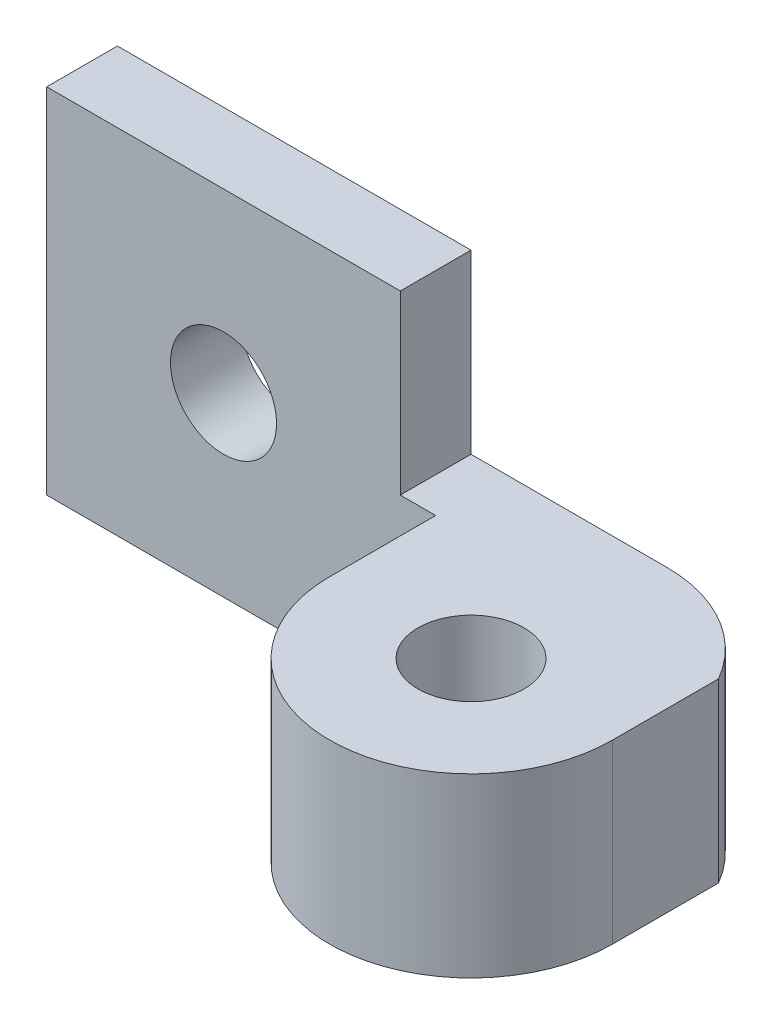
ISO-10303-21;
HEADER;
FILE_DESCRIPTION(('STEP AP214'),'2;1');
FILE_NAME('part.step','',(''),(''),'','','');
FILE_SCHEMA(('AUTOMOTIVE_DESIGN { 1 0 10303 214 1 1 1 1 }'));
ENDSEC;
DATA;
#1=APPLICATION_CONTEXT('core data for automotive mechanical design processes');
#2=APPLICATION_PROTOCOL_DEFINITION('international standard','automotive_design',2000,#1);
#3=PRODUCT_CONTEXT('',#1,'mechanical');
#4=PRODUCT('Part','Part','',(#3));
#5=PRODUCT_RELATED_PRODUCT_CATEGORY('part','',(#4));
#6=PRODUCT_DEFINITION_FORMATION('','',#4);
#7=PRODUCT_DEFINITION_CONTEXT('part definition',#1,'design');
#8=PRODUCT_DEFINITION('design','',#6,#7);
#9=PRODUCT_DEFINITION_SHAPE('','',#8);
#10=(LENGTH_UNIT() NAMED_UNIT(*) SI_UNIT(.MILLI.,.METRE.));
#11=(NAMED_UNIT(*) PLANE_ANGLE_UNIT() SI_UNIT($,.RADIAN.));
#12=(NAMED_UNIT(*) SI_UNIT($,.STERADIAN.) SOLID_ANGLE_UNIT());
#13=UNCERTAINTY_MEASURE_WITH_UNIT(LENGTH_MEASURE(1.E-05),#10,'distance_accuracy_value','');
#14=(GEOMETRIC_REPRESENTATION_CONTEXT(3) GLOBAL_UNCERTAINTY_ASSIGNED_CONTEXT((#13)) GLOBAL_UNIT_ASSIGNED_CONTEXT((#10,
#11,#12)) REPRESENTATION_CONTEXT('',''));
#15=CARTESIAN_POINT('',(0.,0.,0.));
#16=DIRECTION('',(0.,0.,1.));
#17=DIRECTION('',(1.,0.,0.));
#18=AXIS2_PLACEMENT_3D('',#15,#16,#17);
#19=CARTESIAN_POINT('',(0.,0.,2.));
#20=DIRECTION('',(0.,0.,1.));
#21=DIRECTION('',(1.,0.,0.));
#22=AXIS2_PLACEMENT_3D('',#19,#20,#21);
#23=PLANE('',#22);
#24=DIRECTION('',(0.,-1.,0.));
#25=VECTOR('',#24,1.);
#26=CARTESIAN_POINT('',(11.,0.,2.));
#27=LINE('',#26,#25);
#28=CARTESIAN_POINT('',(11.,5.,2.));
#29=VERTEX_POINT('',#28);
#30=CARTESIAN_POINT('',(11.,0.,2.));
#31=VERTEX_POINT('',#30);
#32=EDGE_CURVE('E52',#29,#31,#27,.T.);
#33=ORIENTED_EDGE('',*,*,#32,.F.);
#34=DIRECTION('',(-1.,0.,0.));
#35=VECTOR('',#34,1.);
#36=CARTESIAN_POINT('',(10.,5.,2.));
#37=LINE('',#36,#35);
#38=CARTESIAN_POINT('',(10.,5.,2.));
#39=VERTEX_POINT('',#38);
#40=EDGE_CURVE('E123',#29,#39,#37,.T.);
#41=ORIENTED_EDGE('',*,*,#40,.T.);
#42=DIRECTION('',(0.,1.,0.));
#43=VECTOR('',#42,1.);
#44=CARTESIAN_POINT('',(10.,10.,2.));
#45=LINE('',#44,#43);
#46=CARTESIAN_POINT('',(10.,10.,2.));
#47=VERTEX_POINT('',#46);
#48=EDGE_CURVE('E164',#39,#47,#45,.T.);
#49=ORIENTED_EDGE('',*,*,#48,.T.);
#50=DIRECTION('',(-1.,0.,0.));
#51=VECTOR('',#50,1.);
#52=CARTESIAN_POINT('',(0.,10.,2.));
#53=LINE('',#52,#51);
#54=CARTESIAN_POINT('',(0.,10.,2.));
#55=VERTEX_POINT('',#54);
#56=EDGE_CURVE('E166',#47,#55,#53,.T.);
#57=ORIENTED_EDGE('',*,*,#56,.T.);
#58=DIRECTION('',(0.,-1.,0.));
#59=VECTOR('',#58,1.);
#60=CARTESIAN_POINT('',(0.,10.,2.));
#61=LINE('',#60,#59);
#62=CARTESIAN_POINT('',(0.,0.,2.));
#63=VERTEX_POINT('',#62);
#64=EDGE_CURVE('E159',#55,#63,#61,.T.);
#65=ORIENTED_EDGE('',*,*,#64,.T.);
#66=DIRECTION('',(1.,0.,0.));
#67=VECTOR('',#66,1.);
#68=CARTESIAN_POINT('',(0.,0.,2.));
#69=LINE('',#68,#67);
#70=EDGE_CURVE('E48',#63,#31,#69,.T.);
#71=ORIENTED_EDGE('',*,*,#70,.T.);
#72=EDGE_LOOP('',(#33,#41,#49,#57,#65,#71));
#73=FACE_BOUND('',#72,.T.);
#74=CARTESIAN_POINT('',(5.,5.,2.));
#75=DIRECTION('',(0.,0.,1.));
#76=DIRECTION('',(1.,0.,0.));
#77=AXIS2_PLACEMENT_3D('',#74,#75,#76);
#78=CIRCLE('',#77,1.5);
#79=CARTESIAN_POINT('',(6.5,5.,2.));
#80=VERTEX_POINT('',#79);
#81=EDGE_CURVE('E153',#80,#80,#78,.T.);
#82=ORIENTED_EDGE('',*,*,#81,.F.);
#83=EDGE_LOOP('',(#82));
#84=FACE_BOUND('',#83,.T.);
#85=ADVANCED_FACE('F33',(#73,#84),#23,.T.);
#86=CARTESIAN_POINT('',(0.,0.,0.));
#87=DIRECTION('',(0.,0.,1.));
#88=DIRECTION('',(1.,0.,0.));
#89=AXIS2_PLACEMENT_3D('',#86,#87,#88);
#90=PLANE('',#89);
#91=DIRECTION('',(0.,1.,0.));
#92=VECTOR('',#91,1.);
#93=CARTESIAN_POINT('',(10.,10.,0.));
#94=LINE('',#93,#92);
#95=CARTESIAN_POINT('',(10.,5.,0.));
#96=VERTEX_POINT('',#95);
#97=CARTESIAN_POINT('',(10.,10.,0.));
#98=VERTEX_POINT('',#97);
#99=EDGE_CURVE('E175',#96,#98,#94,.T.);
#100=ORIENTED_EDGE('',*,*,#99,.F.);
#101=DIRECTION('',(-1.,0.,0.));
#102=VECTOR('',#101,1.);
#103=CARTESIAN_POINT('',(10.,5.,0.));
#104=LINE('',#103,#102);
#105=CARTESIAN_POINT('',(15.5358983848622,5.,0.));
#106=VERTEX_POINT('',#105);
#107=EDGE_CURVE('E173',#106,#96,#104,.T.);
#108=ORIENTED_EDGE('',*,*,#107,.F.);
#109=DIRECTION('',(0.,-1.,0.));
#110=VECTOR('',#109,1.);
#111=CARTESIAN_POINT('',(15.5358983848622,5.,0.));
#112=LINE('',#111,#110);
#113=CARTESIAN_POINT('',(15.5358983848622,0.,0.));
#114=VERTEX_POINT('',#113);
#115=EDGE_CURVE('E112',#106,#114,#112,.T.);
#116=ORIENTED_EDGE('',*,*,#115,.T.);
#117=DIRECTION('',(1.,0.,0.));
#118=VECTOR('',#117,1.);
#119=CARTESIAN_POINT('',(0.,0.,0.));
#120=LINE('',#119,#118);
#121=CARTESIAN_POINT('',(0.,0.,0.));
#122=VERTEX_POINT('',#121);
#123=EDGE_CURVE('E171',#122,#114,#120,.T.);
#124=ORIENTED_EDGE('',*,*,#123,.F.);
#125=DIRECTION('',(0.,-1.,0.));
#126=VECTOR('',#125,1.);
#127=CARTESIAN_POINT('',(0.,10.,0.));
#128=LINE('',#127,#126);
#129=CARTESIAN_POINT('',(0.,10.,0.));
#130=VERTEX_POINT('',#129);
#131=EDGE_CURVE('E156',#130,#122,#128,.T.);
#132=ORIENTED_EDGE('',*,*,#131,.F.);
#133=DIRECTION('',(-1.,0.,0.));
#134=VECTOR('',#133,1.);
#135=CARTESIAN_POINT('',(0.,10.,0.));
#136=LINE('',#135,#134);
#137=EDGE_CURVE('E161',#98,#130,#136,.T.);
#138=ORIENTED_EDGE('',*,*,#137,.F.);
#139=EDGE_LOOP('',(#100,#108,#116,#124,#132,#138));
#140=FACE_BOUND('',#139,.T.);
#141=CARTESIAN_POINT('',(5.,5.,0.));
#142=DIRECTION('',(0.,0.,1.));
#143=DIRECTION('',(1.,0.,0.));
#144=AXIS2_PLACEMENT_3D('',#141,#142,#143);
#145=CIRCLE('',#144,1.5);
#146=CARTESIAN_POINT('',(6.5,5.,0.));
#147=VERTEX_POINT('',#146);
#148=EDGE_CURVE('E152',#147,#147,#145,.T.);
#149=ORIENTED_EDGE('',*,*,#148,.T.);
#150=EDGE_LOOP('',(#149));
#151=FACE_BOUND('',#150,.T.);
#152=ADVANCED_FACE('F190',(#140,#151),#90,.F.);
#153=CARTESIAN_POINT('',(0.,10.,2.));
#154=DIRECTION('',(1.,0.,0.));
#155=DIRECTION('',(0.,1.,0.));
#156=AXIS2_PLACEMENT_3D('',#153,#154,#155);
#157=PLANE('',#156);
#158=ORIENTED_EDGE('',*,*,#131,.T.);
#159=DIRECTION('',(0.,0.,-1.));
#160=VECTOR('',#159,1.);
#161=CARTESIAN_POINT('',(0.,0.,2.));
#162=LINE('',#161,#160);
#163=EDGE_CURVE('E11',#63,#122,#162,.T.);
#164=ORIENTED_EDGE('',*,*,#163,.F.);
#165=ORIENTED_EDGE('',*,*,#64,.F.);
#166=DIRECTION('',(0.,0.,-1.));
#167=VECTOR('',#166,1.);
#168=CARTESIAN_POINT('',(0.,10.,2.));
#169=LINE('',#168,#167);
#170=EDGE_CURVE('E168',#55,#130,#169,.T.);
#171=ORIENTED_EDGE('',*,*,#170,.T.);
#172=EDGE_LOOP('',(#158,#164,#165,#171));
#173=FACE_BOUND('',#172,.T.);
#174=ADVANCED_FACE('F35',(#173),#157,.F.);
#175=CARTESIAN_POINT('',(0.,0.,2.));
#176=DIRECTION('',(0.,1.,0.));
#177=DIRECTION('',(0.,0.,1.));
#178=AXIS2_PLACEMENT_3D('',#175,#176,#177);
#179=PLANE('',#178);
#180=DIRECTION('',(0.,0.,-1.));
#181=VECTOR('',#180,1.);
#182=CARTESIAN_POINT('',(11.,0.,5.));
#183=LINE('',#182,#181);
#184=CARTESIAN_POINT('',(11.,0.,5.));
#185=VERTEX_POINT('',#184);
#186=EDGE_CURVE('E107',#185,#31,#183,.T.);
#187=ORIENTED_EDGE('',*,*,#186,.T.);
#188=ORIENTED_EDGE('',*,*,#70,.F.);
#189=ORIENTED_EDGE('',*,*,#163,.T.);
#190=ORIENTED_EDGE('',*,*,#123,.T.);
#191=CARTESIAN_POINT('',(15.5358983848622,0.,4.));
#192=DIRECTION('',(0.,-1.,0.));
#193=DIRECTION('',(0.,0.,1.));
#194=AXIS2_PLACEMENT_3D('',#191,#192,#193);
#195=CIRCLE('',#194,4.);
#196=CARTESIAN_POINT('',(19.,0.,2.));
#197=VERTEX_POINT('',#196);
#198=EDGE_CURVE('E131',#114,#197,#195,.T.);
#199=ORIENTED_EDGE('',*,*,#198,.T.);
#200=DIRECTION('',(0.,0.,1.));
#201=VECTOR('',#200,1.);
#202=CARTESIAN_POINT('',(19.,0.,5.));
#203=LINE('',#202,#201);
#204=CARTESIAN_POINT('',(19.,0.,5.));
#205=VERTEX_POINT('',#204);
#206=EDGE_CURVE('E128',#197,#205,#203,.T.);
#207=ORIENTED_EDGE('',*,*,#206,.T.);
#208=CARTESIAN_POINT('',(15.,0.,5.));
#209=DIRECTION('',(0.,-1.,0.));
#210=DIRECTION('',(0.,0.,1.));
#211=AXIS2_PLACEMENT_3D('',#208,#209,#210);
#212=CIRCLE('',#211,4.);
#213=EDGE_CURVE('E140',#205,#185,#212,.T.);
#214=ORIENTED_EDGE('',*,*,#213,.T.);
#215=EDGE_LOOP('',(#187,#188,#189,#190,#199,#207,#214));
#216=FACE_BOUND('',#215,.T.);
#217=CARTESIAN_POINT('',(15.,0.,5.));
#218=DIRECTION('',(0.,-1.,0.));
#219=DIRECTION('',(0.,0.,-1.));
#220=AXIS2_PLACEMENT_3D('',#217,#218,#219);
#221=CIRCLE('',#220,1.5);
#222=CARTESIAN_POINT('',(15.,0.,3.5));
#223=VERTEX_POINT('',#222);
#224=EDGE_CURVE('E134',#223,#223,#221,.T.);
#225=ORIENTED_EDGE('',*,*,#224,.F.);
#226=EDGE_LOOP('',(#225));
#227=FACE_BOUND('',#226,.T.);
#228=ADVANCED_FACE('F216',(#216,#227),#179,.F.);
#229=CARTESIAN_POINT('',(10.,5.,2.));
#230=DIRECTION('',(0.,-1.,0.));
#231=DIRECTION('',(0.,0.,-1.));
#232=AXIS2_PLACEMENT_3D('',#229,#230,#231);
#233=PLANE('',#232);
#234=ORIENTED_EDGE('',*,*,#40,.F.);
#235=DIRECTION('',(0.,0.,-1.));
#236=VECTOR('',#235,1.);
#237=CARTESIAN_POINT('',(11.,5.,5.));
#238=LINE('',#237,#236);
#239=CARTESIAN_POINT('',(11.,5.,5.));
#240=VERTEX_POINT('',#239);
#241=EDGE_CURVE('E105',#240,#29,#238,.T.);
#242=ORIENTED_EDGE('',*,*,#241,.F.);
#243=CARTESIAN_POINT('',(15.,5.,5.));
#244=DIRECTION('',(0.,-1.,0.));
#245=DIRECTION('',(0.,0.,1.));
#246=AXIS2_PLACEMENT_3D('',#243,#244,#245);
#247=CIRCLE('',#246,4.);
#248=CARTESIAN_POINT('',(19.,5.,5.));
#249=VERTEX_POINT('',#248);
#250=EDGE_CURVE('E120',#249,#240,#247,.T.);
#251=ORIENTED_EDGE('',*,*,#250,.F.);
#252=DIRECTION('',(0.,0.,1.));
#253=VECTOR('',#252,1.);
#254=CARTESIAN_POINT('',(19.,5.,5.));
#255=LINE('',#254,#253);
#256=CARTESIAN_POINT('',(19.,5.,2.));
#257=VERTEX_POINT('',#256);
#258=EDGE_CURVE('E113',#257,#249,#255,.T.);
#259=ORIENTED_EDGE('',*,*,#258,.F.);
#260=CARTESIAN_POINT('',(15.5358983848622,5.,4.));
#261=DIRECTION('',(0.,-1.,0.));
#262=DIRECTION('',(0.,0.,1.));
#263=AXIS2_PLACEMENT_3D('',#260,#261,#262);
#264=CIRCLE('',#263,4.);
#265=EDGE_CURVE('E124',#106,#257,#264,.T.);
#266=ORIENTED_EDGE('',*,*,#265,.F.);
#267=ORIENTED_EDGE('',*,*,#107,.T.);
#268=DIRECTION('',(0.,0.,-1.));
#269=VECTOR('',#268,1.);
#270=CARTESIAN_POINT('',(10.,5.,2.));
#271=LINE('',#270,#269);
#272=EDGE_CURVE('E41',#39,#96,#271,.T.);
#273=ORIENTED_EDGE('',*,*,#272,.F.);
#274=EDGE_LOOP('',(#234,#242,#251,#259,#266,#267,#273));
#275=FACE_BOUND('',#274,.T.);
#276=CARTESIAN_POINT('',(15.,5.,5.));
#277=DIRECTION('',(0.,-1.,0.));
#278=DIRECTION('',(0.,0.,-1.));
#279=AXIS2_PLACEMENT_3D('',#276,#277,#278);
#280=CIRCLE('',#279,1.5);
#281=CARTESIAN_POINT('',(15.,5.,3.5));
#282=VERTEX_POINT('',#281);
#283=EDGE_CURVE('E142',#282,#282,#280,.T.);
#284=ORIENTED_EDGE('',*,*,#283,.T.);
#285=EDGE_LOOP('',(#284));
#286=FACE_BOUND('',#285,.T.);
#287=ADVANCED_FACE('F117',(#275,#286),#233,.F.);
#288=CARTESIAN_POINT('',(10.,10.,2.));
#289=DIRECTION('',(-1.,0.,0.));
#290=DIRECTION('',(0.,-1.,0.));
#291=AXIS2_PLACEMENT_3D('',#288,#289,#290);
#292=PLANE('',#291);
#293=ORIENTED_EDGE('',*,*,#99,.T.);
#294=DIRECTION('',(0.,0.,-1.));
#295=VECTOR('',#294,1.);
#296=CARTESIAN_POINT('',(10.,10.,2.));
#297=LINE('',#296,#295);
#298=EDGE_CURVE('E180',#47,#98,#297,.T.);
#299=ORIENTED_EDGE('',*,*,#298,.F.);
#300=ORIENTED_EDGE('',*,*,#48,.F.);
#301=ORIENTED_EDGE('',*,*,#272,.T.);
#302=EDGE_LOOP('',(#293,#299,#300,#301));
#303=FACE_BOUND('',#302,.T.);
#304=ADVANCED_FACE('F186',(#303),#292,.F.);
#305=CARTESIAN_POINT('',(0.,10.,2.));
#306=DIRECTION('',(0.,-1.,0.));
#307=DIRECTION('',(1.,0.,0.));
#308=AXIS2_PLACEMENT_3D('',#305,#306,#307);
#309=PLANE('',#308);
#310=ORIENTED_EDGE('',*,*,#137,.T.);
#311=ORIENTED_EDGE('',*,*,#170,.F.);
#312=ORIENTED_EDGE('',*,*,#56,.F.);
#313=ORIENTED_EDGE('',*,*,#298,.T.);
#314=EDGE_LOOP('',(#310,#311,#312,#313));
#315=FACE_BOUND('',#314,.T.);
#316=ADVANCED_FACE('F196',(#315),#309,.F.);
#317=CARTESIAN_POINT('',(5.,5.,2.));
#318=DIRECTION('',(0.,0.,-1.));
#319=DIRECTION('',(-1.,0.,0.));
#320=AXIS2_PLACEMENT_3D('',#317,#318,#319);
#321=CYLINDRICAL_SURFACE('',#320,1.5);
#322=ORIENTED_EDGE('',*,*,#81,.T.);
#323=EDGE_LOOP('',(#322));
#324=FACE_BOUND('',#323,.T.);
#325=ORIENTED_EDGE('',*,*,#148,.F.);
#326=EDGE_LOOP('',(#325));
#327=FACE_BOUND('',#326,.T.);
#328=ADVANCED_FACE('F206',(#324,#327),#321,.F.);
#329=CARTESIAN_POINT('',(15.,5.,5.));
#330=DIRECTION('',(0.,-1.,0.));
#331=DIRECTION('',(0.,0.,-1.));
#332=AXIS2_PLACEMENT_3D('',#329,#330,#331);
#333=CYLINDRICAL_SURFACE('',#332,4.);
#334=ORIENTED_EDGE('',*,*,#213,.F.);
#335=DIRECTION('',(0.,-1.,0.));
#336=VECTOR('',#335,1.);
#337=CARTESIAN_POINT('',(19.,5.,5.));
#338=LINE('',#337,#336);
#339=EDGE_CURVE('E127',#249,#205,#338,.T.);
#340=ORIENTED_EDGE('',*,*,#339,.F.);
#341=ORIENTED_EDGE('',*,*,#250,.T.);
#342=DIRECTION('',(0.,-1.,0.));
#343=VECTOR('',#342,1.);
#344=CARTESIAN_POINT('',(11.,5.,5.));
#345=LINE('',#344,#343);
#346=EDGE_CURVE('E102',#240,#185,#345,.T.);
#347=ORIENTED_EDGE('',*,*,#346,.T.);
#348=EDGE_LOOP('',(#334,#340,#341,#347));
#349=FACE_BOUND('',#348,.T.);
#350=ADVANCED_FACE('F126',(#349),#333,.T.);
#351=CARTESIAN_POINT('',(19.,5.,5.));
#352=DIRECTION('',(1.,0.,0.));
#353=DIRECTION('',(0.,0.,-1.));
#354=AXIS2_PLACEMENT_3D('',#351,#352,#353);
#355=PLANE('',#354);
#356=ORIENTED_EDGE('',*,*,#206,.F.);
#357=DIRECTION('',(0.,-1.,0.));
#358=VECTOR('',#357,1.);
#359=CARTESIAN_POINT('',(19.,5.,2.));
#360=LINE('',#359,#358);
#361=EDGE_CURVE('E147',#257,#197,#360,.T.);
#362=ORIENTED_EDGE('',*,*,#361,.F.);
#363=ORIENTED_EDGE('',*,*,#258,.T.);
#364=ORIENTED_EDGE('',*,*,#339,.T.);
#365=EDGE_LOOP('',(#356,#362,#363,#364));
#366=FACE_BOUND('',#365,.T.);
#367=ADVANCED_FACE('F243',(#366),#355,.T.);
#368=CARTESIAN_POINT('',(15.5358983848622,5.,4.));
#369=DIRECTION('',(0.,-1.,0.));
#370=DIRECTION('',(0.,0.,-1.));
#371=AXIS2_PLACEMENT_3D('',#368,#369,#370);
#372=CYLINDRICAL_SURFACE('',#371,4.);
#373=ORIENTED_EDGE('',*,*,#198,.F.);
#374=ORIENTED_EDGE('',*,*,#115,.F.);
#375=ORIENTED_EDGE('',*,*,#265,.T.);
#376=ORIENTED_EDGE('',*,*,#361,.T.);
#377=EDGE_LOOP('',(#373,#374,#375,#376));
#378=FACE_BOUND('',#377,.T.);
#379=ADVANCED_FACE('F240',(#378),#372,.T.);
#380=CARTESIAN_POINT('',(11.,5.,5.));
#381=DIRECTION('',(-1.,0.,0.));
#382=DIRECTION('',(0.,0.,1.));
#383=AXIS2_PLACEMENT_3D('',#380,#381,#382);
#384=PLANE('',#383);
#385=ORIENTED_EDGE('',*,*,#241,.T.);
#386=ORIENTED_EDGE('',*,*,#32,.T.);
#387=ORIENTED_EDGE('',*,*,#186,.F.);
#388=ORIENTED_EDGE('',*,*,#346,.F.);
#389=EDGE_LOOP('',(#385,#386,#387,#388));
#390=FACE_BOUND('',#389,.T.);
#391=ADVANCED_FACE('F104',(#390),#384,.T.);
#392=CARTESIAN_POINT('',(15.,5.,5.));
#393=DIRECTION('',(0.,-1.,0.));
#394=DIRECTION('',(0.,0.,-1.));
#395=AXIS2_PLACEMENT_3D('',#392,#393,#394);
#396=CYLINDRICAL_SURFACE('',#395,1.5);
#397=ORIENTED_EDGE('',*,*,#283,.F.);
#398=EDGE_LOOP('',(#397));
#399=FACE_BOUND('',#398,.T.);
#400=ORIENTED_EDGE('',*,*,#224,.T.);
#401=EDGE_LOOP('',(#400));
#402=FACE_BOUND('',#401,.T.);
#403=ADVANCED_FACE('F234',(#399,#402),#396,.F.);
#404=CLOSED_SHELL('',(#85,#152,#174,#228,#287,#304,#316,#328,#350,#367,#379,#391,#403));
#405=MANIFOLD_SOLID_BREP('B2',#404);
#406=ADVANCED_BREP_SHAPE_REPRESENTATION('',(#18,#405),#14);
#407=SHAPE_DEFINITION_REPRESENTATION(#9,#406);
ENDSEC;
END-ISO-10303-21;
